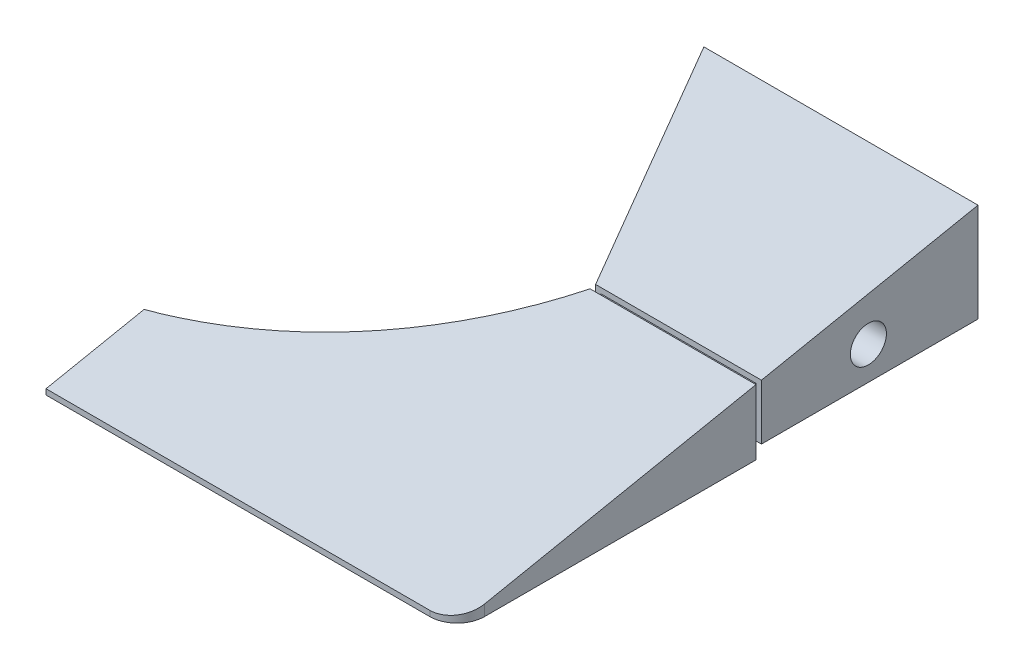
ISO-10303-21;
HEADER;
FILE_DESCRIPTION(('STEP AP214'),'2;1');
FILE_NAME('part.step','',(''),(''),'','','');
FILE_SCHEMA(('AUTOMOTIVE_DESIGN { 1 0 10303 214 1 1 1 1 }'));
ENDSEC;
DATA;
#1=APPLICATION_CONTEXT('core data for automotive mechanical design processes');
#2=APPLICATION_PROTOCOL_DEFINITION('international standard','automotive_design',2000,#1);
#3=PRODUCT_CONTEXT('',#1,'mechanical');
#4=PRODUCT('Part','Part','',(#3));
#5=PRODUCT_RELATED_PRODUCT_CATEGORY('part','',(#4));
#6=PRODUCT_DEFINITION_FORMATION('','',#4);
#7=PRODUCT_DEFINITION_CONTEXT('part definition',#1,'design');
#8=PRODUCT_DEFINITION('design','',#6,#7);
#9=PRODUCT_DEFINITION_SHAPE('','',#8);
#10=(LENGTH_UNIT() NAMED_UNIT(*) SI_UNIT(.MILLI.,.METRE.));
#11=(NAMED_UNIT(*) PLANE_ANGLE_UNIT() SI_UNIT($,.RADIAN.));
#12=(NAMED_UNIT(*) SI_UNIT($,.STERADIAN.) SOLID_ANGLE_UNIT());
#13=UNCERTAINTY_MEASURE_WITH_UNIT(LENGTH_MEASURE(1.E-05),#10,'distance_accuracy_value','');
#14=(GEOMETRIC_REPRESENTATION_CONTEXT(3) GLOBAL_UNCERTAINTY_ASSIGNED_CONTEXT((#13)) GLOBAL_UNIT_ASSIGNED_CONTEXT((#10,
#11,#12)) REPRESENTATION_CONTEXT('',''));
#15=CARTESIAN_POINT('',(0.,0.,0.));
#16=DIRECTION('',(0.,0.,1.));
#17=DIRECTION('',(1.,0.,0.));
#18=AXIS2_PLACEMENT_3D('',#15,#16,#17);
#19=CARTESIAN_POINT('',(0.,0.,95.));
#20=DIRECTION('',(0.,0.,1.));
#21=DIRECTION('',(1.,0.,0.));
#22=AXIS2_PLACEMENT_3D('',#19,#20,#21);
#23=PLANE('',#22);
#24=DIRECTION('',(-1.,0.,0.));
#25=VECTOR('',#24,1.);
#26=CARTESIAN_POINT('',(267.812259244849,-8.99999999999993,95.));
#27=LINE('',#26,#25);
#28=CARTESIAN_POINT('',(60.,-9.,95.));
#29=VERTEX_POINT('',#28);
#30=CARTESIAN_POINT('',(-10.,-9.00000000000003,95.));
#31=VERTEX_POINT('',#30);
#32=EDGE_CURVE('E202',#29,#31,#27,.T.);
#33=ORIENTED_EDGE('',*,*,#32,.T.);
#34=DIRECTION('',(0.,1.,0.));
#35=VECTOR('',#34,1.);
#36=CARTESIAN_POINT('',(-9.99999999999999,-24.6539333542928,95.));
#37=LINE('',#36,#35);
#38=CARTESIAN_POINT('',(-10.,-10.,95.));
#39=VERTEX_POINT('',#38);
#40=EDGE_CURVE('E147',#39,#31,#37,.T.);
#41=ORIENTED_EDGE('',*,*,#40,.F.);
#42=DIRECTION('',(1.,0.,0.));
#43=VECTOR('',#42,1.);
#44=CARTESIAN_POINT('',(-65.,-10.,95.));
#45=LINE('',#44,#43);
#46=CARTESIAN_POINT('',(60.,-10.,95.));
#47=VERTEX_POINT('',#46);
#48=EDGE_CURVE('E178',#39,#47,#45,.T.);
#49=ORIENTED_EDGE('',*,*,#48,.T.);
#50=DIRECTION('',(0.,1.,0.));
#51=VECTOR('',#50,1.);
#52=CARTESIAN_POINT('',(60.,-9.,95.));
#53=LINE('',#52,#51);
#54=EDGE_CURVE('E169',#47,#29,#53,.T.);
#55=ORIENTED_EDGE('',*,*,#54,.T.);
#56=EDGE_LOOP('',(#33,#41,#49,#55));
#57=FACE_BOUND('',#56,.T.);
#58=ADVANCED_FACE('F39',(#57),#23,.T.);
#59=CARTESIAN_POINT('',(267.812259244849,10.0000000000001,0.));
#60=DIRECTION('',(0.,-0.98058067569092,-0.196116135138184));
#61=DIRECTION('',(0.,0.196116135138184,-0.98058067569092));
#62=AXIS2_PLACEMENT_3D('',#59,#60,#61);
#63=PLANE('',#62);
#64=DIRECTION('',(0.,-0.196116135138184,0.98058067569092));
#65=VECTOR('',#64,1.);
#66=CARTESIAN_POINT('',(-10.,-5.42201027736971,77.1100513868484));
#67=LINE('',#66,#65);
#68=CARTESIAN_POINT('',(-10.0000000000001,-5.42201027736971,77.1100513868484));
#69=VERTEX_POINT('',#68);
#70=EDGE_CURVE('E144',#69,#31,#67,.T.);
#71=ORIENTED_EDGE('',*,*,#70,.T.);
#72=ORIENTED_EDGE('',*,*,#32,.F.);
#73=CARTESIAN_POINT('',(60.,-8.,90.));
#74=DIRECTION('',(0.,-0.98058067569092,-0.196116135138184));
#75=DIRECTION('',(0.,-0.196116135138184,0.98058067569092));
#76=AXIS2_PLACEMENT_3D('',#73,#74,#75);
#77=ELLIPSE('',#76,5.09901951359278,5.);
#78=CARTESIAN_POINT('',(65.,-8.,90.));
#79=VERTEX_POINT('',#78);
#80=EDGE_CURVE('E175',#29,#79,#77,.F.);
#81=ORIENTED_EDGE('',*,*,#80,.T.);
#82=DIRECTION('',(0.,-0.196116135138184,0.98058067569092));
#83=VECTOR('',#82,1.);
#84=CARTESIAN_POINT('',(65.,-8.26923076923077,91.3461538461539));
#85=LINE('',#84,#83);
#86=CARTESIAN_POINT('',(65.,1.89999999999999,40.5));
#87=VERTEX_POINT('',#86);
#88=EDGE_CURVE('E204',#87,#79,#85,.T.);
#89=ORIENTED_EDGE('',*,*,#88,.F.);
#90=DIRECTION('',(-1.,0.,0.));
#91=VECTOR('',#90,1.);
#92=CARTESIAN_POINT('',(267.812259244849,1.90000000000006,40.5));
#93=LINE('',#92,#91);
#94=CARTESIAN_POINT('',(34.741705057642,1.89999999999998,40.5));
#95=VERTEX_POINT('',#94);
#96=EDGE_CURVE('E48',#87,#95,#93,.T.);
#97=ORIENTED_EDGE('',*,*,#96,.T.);
#98=CARTESIAN_POINT('',(-30.4033638672732,8.69399998459829,6.53000007700834));
#99=DIRECTION('',(0.,-0.98058067569092,-0.196116135138184));
#100=DIRECTION('',(0.,0.196116135138184,-0.98058067569092));
#101=AXIS2_PLACEMENT_3D('',#98,#99,#100);
#102=ELLIPSE('',#101,74.9249927327324,73.47);
#103=EDGE_CURVE('E159',#69,#95,#102,.F.);
#104=ORIENTED_EDGE('',*,*,#103,.F.);
#105=EDGE_LOOP('',(#71,#72,#81,#89,#97,#104));
#106=FACE_BOUND('',#105,.T.);
#107=ADVANCED_FACE('F166',(#106),#63,.F.);
#108=CARTESIAN_POINT('',(-30.4033638672732,-10.001,6.53000007700834));
#109=DIRECTION('',(0.,1.,0.));
#110=DIRECTION('',(0.,0.,1.));
#111=AXIS2_PLACEMENT_3D('',#108,#109,#110);
#112=CYLINDRICAL_SURFACE('',#111,73.47);
#113=DIRECTION('',(0.,1.,0.));
#114=VECTOR('',#113,1.);
#115=CARTESIAN_POINT('',(-10.,-10.001,77.1100513868483));
#116=LINE('',#115,#114);
#117=CARTESIAN_POINT('',(-10.,-10.,77.1100513868483));
#118=VERTEX_POINT('',#117);
#119=EDGE_CURVE('E55',#118,#69,#116,.T.);
#120=ORIENTED_EDGE('',*,*,#119,.T.);
#121=ORIENTED_EDGE('',*,*,#103,.T.);
#122=DIRECTION('',(0.,1.,0.));
#123=VECTOR('',#122,1.);
#124=CARTESIAN_POINT('',(34.741705057642,-10.001,40.5));
#125=LINE('',#124,#123);
#126=CARTESIAN_POINT('',(34.741705057642,-10.,40.5));
#127=VERTEX_POINT('',#126);
#128=EDGE_CURVE('E205',#95,#127,#125,.F.);
#129=ORIENTED_EDGE('',*,*,#128,.T.);
#130=CARTESIAN_POINT('',(-30.4033638672732,-10.,6.53000007700834));
#131=DIRECTION('',(0.,1.,0.));
#132=DIRECTION('',(0.,0.,1.));
#133=AXIS2_PLACEMENT_3D('',#130,#131,#132);
#134=CIRCLE('',#133,73.47);
#135=EDGE_CURVE('E162',#127,#118,#134,.F.);
#136=ORIENTED_EDGE('',*,*,#135,.T.);
#137=EDGE_LOOP('',(#120,#121,#129,#136));
#138=FACE_BOUND('',#137,.T.);
#139=ADVANCED_FACE('F158',(#138),#112,.F.);
#140=CARTESIAN_POINT('',(-65.,-10.,95.));
#141=DIRECTION('',(0.,1.,0.));
#142=DIRECTION('',(0.,0.,1.));
#143=AXIS2_PLACEMENT_3D('',#140,#141,#142);
#144=PLANE('',#143);
#145=DIRECTION('',(0.,0.,-1.));
#146=VECTOR('',#145,1.);
#147=CARTESIAN_POINT('',(-10.,-10.,73.2636667714638));
#148=LINE('',#147,#146);
#149=EDGE_CURVE('E154',#39,#118,#148,.T.);
#150=ORIENTED_EDGE('',*,*,#149,.T.);
#151=ORIENTED_EDGE('',*,*,#135,.F.);
#152=DIRECTION('',(1.,0.,0.));
#153=VECTOR('',#152,1.);
#154=CARTESIAN_POINT('',(-65.,-10.,40.5));
#155=LINE('',#154,#153);
#156=CARTESIAN_POINT('',(65.,-10.,40.5));
#157=VERTEX_POINT('',#156);
#158=EDGE_CURVE('E210',#127,#157,#155,.T.);
#159=ORIENTED_EDGE('',*,*,#158,.T.);
#160=DIRECTION('',(0.,0.,-1.));
#161=VECTOR('',#160,1.);
#162=CARTESIAN_POINT('',(65.,-10.,95.));
#163=LINE('',#162,#161);
#164=CARTESIAN_POINT('',(65.,-10.,90.));
#165=VERTEX_POINT('',#164);
#166=EDGE_CURVE('E170',#165,#157,#163,.T.);
#167=ORIENTED_EDGE('',*,*,#166,.F.);
#168=CARTESIAN_POINT('',(60.,-10.,90.));
#169=DIRECTION('',(0.,1.,0.));
#170=DIRECTION('',(0.,0.,1.));
#171=AXIS2_PLACEMENT_3D('',#168,#169,#170);
#172=CIRCLE('',#171,5.);
#173=EDGE_CURVE('E188',#165,#47,#172,.F.);
#174=ORIENTED_EDGE('',*,*,#173,.T.);
#175=ORIENTED_EDGE('',*,*,#48,.F.);
#176=EDGE_LOOP('',(#150,#151,#159,#167,#174,#175));
#177=FACE_BOUND('',#176,.T.);
#178=ADVANCED_FACE('F197',(#177),#144,.F.);
#179=CARTESIAN_POINT('',(60.,0.,90.));
#180=DIRECTION('',(0.,-1.,0.));
#181=DIRECTION('',(0.,0.,-1.));
#182=AXIS2_PLACEMENT_3D('',#179,#180,#181);
#183=CYLINDRICAL_SURFACE('',#182,5.);
#184=ORIENTED_EDGE('',*,*,#173,.F.);
#185=DIRECTION('',(0.,1.,0.));
#186=VECTOR('',#185,1.);
#187=CARTESIAN_POINT('',(65.,-10.,90.));
#188=LINE('',#187,#186);
#189=EDGE_CURVE('E185',#79,#165,#188,.F.);
#190=ORIENTED_EDGE('',*,*,#189,.F.);
#191=ORIENTED_EDGE('',*,*,#80,.F.);
#192=ORIENTED_EDGE('',*,*,#54,.F.);
#193=EDGE_LOOP('',(#184,#190,#191,#192));
#194=FACE_BOUND('',#193,.T.);
#195=ADVANCED_FACE('F41',(#194),#183,.T.);
#196=CARTESIAN_POINT('',(65.,10.,95.));
#197=DIRECTION('',(-1.,0.,0.));
#198=DIRECTION('',(0.,0.,1.));
#199=AXIS2_PLACEMENT_3D('',#196,#197,#198);
#200=PLANE('',#199);
#201=ORIENTED_EDGE('',*,*,#166,.T.);
#202=DIRECTION('',(0.,-1.,0.));
#203=VECTOR('',#202,1.);
#204=CARTESIAN_POINT('',(65.,1.89999999999999,40.5));
#205=LINE('',#204,#203);
#206=EDGE_CURVE('E218',#87,#157,#205,.T.);
#207=ORIENTED_EDGE('',*,*,#206,.F.);
#208=ORIENTED_EDGE('',*,*,#88,.T.);
#209=ORIENTED_EDGE('',*,*,#189,.T.);
#210=EDGE_LOOP('',(#201,#207,#208,#209));
#211=FACE_BOUND('',#210,.T.);
#212=ADVANCED_FACE('F328',(#211),#200,.F.);
#213=CARTESIAN_POINT('',(-65.,1.89999999999999,40.5));
#214=DIRECTION('',(0.,0.,1.));
#215=DIRECTION('',(1.,0.,0.));
#216=AXIS2_PLACEMENT_3D('',#213,#214,#215);
#217=PLANE('',#216);
#218=DIRECTION('',(-1.,0.,0.));
#219=VECTOR('',#218,1.);
#220=CARTESIAN_POINT('',(35.75,1.09999999999999,40.5));
#221=LINE('',#220,#219);
#222=CARTESIAN_POINT('',(64.,1.09999999999999,40.5));
#223=VERTEX_POINT('',#222);
#224=CARTESIAN_POINT('',(35.75,1.09999999999999,40.5));
#225=VERTEX_POINT('',#224);
#226=EDGE_CURVE('E222',#223,#225,#221,.T.);
#227=ORIENTED_EDGE('',*,*,#226,.T.);
#228=DIRECTION('',(0.,-1.,0.));
#229=VECTOR('',#228,1.);
#230=CARTESIAN_POINT('',(35.75,1.09999999999999,40.5));
#231=LINE('',#230,#229);
#232=CARTESIAN_POINT('',(35.75,-7.,40.5));
#233=VERTEX_POINT('',#232);
#234=EDGE_CURVE('E235',#225,#233,#231,.T.);
#235=ORIENTED_EDGE('',*,*,#234,.T.);
#236=DIRECTION('',(1.,0.,0.));
#237=VECTOR('',#236,1.);
#238=CARTESIAN_POINT('',(35.75,-7.,40.5));
#239=LINE('',#238,#237);
#240=CARTESIAN_POINT('',(64.,-7.,40.5));
#241=VERTEX_POINT('',#240);
#242=EDGE_CURVE('E231',#233,#241,#239,.T.);
#243=ORIENTED_EDGE('',*,*,#242,.T.);
#244=DIRECTION('',(0.,1.,0.));
#245=VECTOR('',#244,1.);
#246=CARTESIAN_POINT('',(64.,1.09999999999999,40.5));
#247=LINE('',#246,#245);
#248=EDGE_CURVE('E226',#241,#223,#247,.T.);
#249=ORIENTED_EDGE('',*,*,#248,.T.);
#250=EDGE_LOOP('',(#227,#235,#243,#249));
#251=FACE_BOUND('',#250,.T.);
#252=ORIENTED_EDGE('',*,*,#206,.T.);
#253=ORIENTED_EDGE('',*,*,#158,.F.);
#254=ORIENTED_EDGE('',*,*,#128,.F.);
#255=ORIENTED_EDGE('',*,*,#96,.F.);
#256=EDGE_LOOP('',(#252,#253,#254,#255));
#257=FACE_BOUND('',#256,.T.);
#258=ADVANCED_FACE('F329',(#251,#257),#217,.F.);
#259=CARTESIAN_POINT('',(35.75,1.09999999999999,95.002));
#260=DIRECTION('',(1.,0.,0.));
#261=DIRECTION('',(0.,0.,-1.));
#262=AXIS2_PLACEMENT_3D('',#259,#260,#261);
#263=PLANE('',#262);
#264=ORIENTED_EDGE('',*,*,#234,.F.);
#265=DIRECTION('',(0.,0.,-1.));
#266=VECTOR('',#265,1.);
#267=CARTESIAN_POINT('',(35.75,1.09999999999999,95.002));
#268=LINE('',#267,#266);
#269=CARTESIAN_POINT('',(35.75,1.09999999999999,39.5));
#270=VERTEX_POINT('',#269);
#271=EDGE_CURVE('E240',#225,#270,#268,.T.);
#272=ORIENTED_EDGE('',*,*,#271,.T.);
#273=DIRECTION('',(0.,-1.,0.));
#274=VECTOR('',#273,1.);
#275=CARTESIAN_POINT('',(35.75,1.09999999999999,39.5));
#276=LINE('',#275,#274);
#277=CARTESIAN_POINT('',(35.75,-7.,39.5));
#278=VERTEX_POINT('',#277);
#279=EDGE_CURVE('E221',#270,#278,#276,.T.);
#280=ORIENTED_EDGE('',*,*,#279,.T.);
#281=DIRECTION('',(0.,0.,-1.));
#282=VECTOR('',#281,1.);
#283=CARTESIAN_POINT('',(35.75,-7.,95.002));
#284=LINE('',#283,#282);
#285=EDGE_CURVE('E239',#233,#278,#284,.T.);
#286=ORIENTED_EDGE('',*,*,#285,.F.);
#287=EDGE_LOOP('',(#264,#272,#280,#286));
#288=FACE_BOUND('',#287,.T.);
#289=ADVANCED_FACE('F331',(#288),#263,.F.);
#290=CARTESIAN_POINT('',(35.75,-7.,95.002));
#291=DIRECTION('',(0.,1.,0.));
#292=DIRECTION('',(0.,0.,1.));
#293=AXIS2_PLACEMENT_3D('',#290,#291,#292);
#294=PLANE('',#293);
#295=ORIENTED_EDGE('',*,*,#242,.F.);
#296=ORIENTED_EDGE('',*,*,#285,.T.);
#297=DIRECTION('',(1.,0.,0.));
#298=VECTOR('',#297,1.);
#299=CARTESIAN_POINT('',(35.75,-7.,39.5));
#300=LINE('',#299,#298);
#301=CARTESIAN_POINT('',(64.,-7.,39.5));
#302=VERTEX_POINT('',#301);
#303=EDGE_CURVE('E256',#278,#302,#300,.T.);
#304=ORIENTED_EDGE('',*,*,#303,.T.);
#305=DIRECTION('',(0.,0.,-1.));
#306=VECTOR('',#305,1.);
#307=CARTESIAN_POINT('',(64.,-7.,95.002));
#308=LINE('',#307,#306);
#309=EDGE_CURVE('E249',#241,#302,#308,.T.);
#310=ORIENTED_EDGE('',*,*,#309,.F.);
#311=EDGE_LOOP('',(#295,#296,#304,#310));
#312=FACE_BOUND('',#311,.T.);
#313=ADVANCED_FACE('F339',(#312),#294,.F.);
#314=CARTESIAN_POINT('',(64.,1.09999999999999,95.002));
#315=DIRECTION('',(-1.,0.,0.));
#316=DIRECTION('',(0.,0.,1.));
#317=AXIS2_PLACEMENT_3D('',#314,#315,#316);
#318=PLANE('',#317);
#319=ORIENTED_EDGE('',*,*,#248,.F.);
#320=ORIENTED_EDGE('',*,*,#309,.T.);
#321=DIRECTION('',(0.,1.,0.));
#322=VECTOR('',#321,1.);
#323=CARTESIAN_POINT('',(64.,1.09999999999999,39.5));
#324=LINE('',#323,#322);
#325=CARTESIAN_POINT('',(64.,1.09999999999999,39.5));
#326=VERTEX_POINT('',#325);
#327=EDGE_CURVE('E260',#302,#326,#324,.T.);
#328=ORIENTED_EDGE('',*,*,#327,.T.);
#329=DIRECTION('',(0.,0.,-1.));
#330=VECTOR('',#329,1.);
#331=CARTESIAN_POINT('',(64.,1.09999999999999,95.002));
#332=LINE('',#331,#330);
#333=EDGE_CURVE('E245',#223,#326,#332,.T.);
#334=ORIENTED_EDGE('',*,*,#333,.F.);
#335=EDGE_LOOP('',(#319,#320,#328,#334));
#336=FACE_BOUND('',#335,.T.);
#337=ADVANCED_FACE('F346',(#336),#318,.F.);
#338=CARTESIAN_POINT('',(35.75,1.09999999999999,95.002));
#339=DIRECTION('',(0.,-1.,0.));
#340=DIRECTION('',(0.,0.,-1.));
#341=AXIS2_PLACEMENT_3D('',#338,#339,#340);
#342=PLANE('',#341);
#343=ORIENTED_EDGE('',*,*,#226,.F.);
#344=ORIENTED_EDGE('',*,*,#333,.T.);
#345=DIRECTION('',(-1.,0.,0.));
#346=VECTOR('',#345,1.);
#347=CARTESIAN_POINT('',(35.75,1.09999999999999,39.5));
#348=LINE('',#347,#346);
#349=EDGE_CURVE('E244',#326,#270,#348,.T.);
#350=ORIENTED_EDGE('',*,*,#349,.T.);
#351=ORIENTED_EDGE('',*,*,#271,.F.);
#352=EDGE_LOOP('',(#343,#344,#350,#351));
#353=FACE_BOUND('',#352,.T.);
#354=ADVANCED_FACE('F334',(#353),#342,.F.);
#355=CARTESIAN_POINT('',(65.,10.,95.));
#356=DIRECTION('',(-1.,0.,0.));
#357=DIRECTION('',(0.,0.,1.));
#358=AXIS2_PLACEMENT_3D('',#355,#356,#357);
#359=PLANE('',#358);
#360=CARTESIAN_POINT('',(65.,-1.945,20.));
#361=DIRECTION('',(1.,0.,0.));
#362=DIRECTION('',(0.,0.,-1.));
#363=AXIS2_PLACEMENT_3D('',#360,#361,#362);
#364=CIRCLE('',#363,3.2899985);
#365=CARTESIAN_POINT('',(65.,-1.945,16.7100015));
#366=VERTEX_POINT('',#365);
#367=EDGE_CURVE('E291',#366,#366,#364,.T.);
#368=ORIENTED_EDGE('',*,*,#367,.F.);
#369=EDGE_LOOP('',(#368));
#370=FACE_BOUND('',#369,.T.);
#371=DIRECTION('',(0.,1.,0.));
#372=VECTOR('',#371,1.);
#373=CARTESIAN_POINT('',(65.,-10.,39.5));
#374=LINE('',#373,#372);
#375=CARTESIAN_POINT('',(65.,-8.,39.5));
#376=VERTEX_POINT('',#375);
#377=CARTESIAN_POINT('',(65.,2.09999999999999,39.5));
#378=VERTEX_POINT('',#377);
#379=EDGE_CURVE('E227',#376,#378,#374,.T.);
#380=ORIENTED_EDGE('',*,*,#379,.F.);
#381=DIRECTION('',(0.,0.,-1.));
#382=VECTOR('',#381,1.);
#383=CARTESIAN_POINT('',(65.,-8.,40.5));
#384=LINE('',#383,#382);
#385=CARTESIAN_POINT('',(65.,-8.,0.));
#386=VERTEX_POINT('',#385);
#387=EDGE_CURVE('E63',#376,#386,#384,.T.);
#388=ORIENTED_EDGE('',*,*,#387,.T.);
#389=DIRECTION('',(0.,1.,0.));
#390=VECTOR('',#389,1.);
#391=CARTESIAN_POINT('',(65.,10.,0.));
#392=LINE('',#391,#390);
#393=CARTESIAN_POINT('',(65.,9.99999999999998,0.));
#394=VERTEX_POINT('',#393);
#395=EDGE_CURVE('E274',#386,#394,#392,.T.);
#396=ORIENTED_EDGE('',*,*,#395,.T.);
#397=DIRECTION('',(0.,-0.196116135138184,0.98058067569092));
#398=VECTOR('',#397,1.);
#399=CARTESIAN_POINT('',(65.,-8.26923076923077,91.3461538461539));
#400=LINE('',#399,#398);
#401=EDGE_CURVE('E270',#394,#378,#400,.T.);
#402=ORIENTED_EDGE('',*,*,#401,.T.);
#403=EDGE_LOOP('',(#380,#388,#396,#402));
#404=FACE_BOUND('',#403,.T.);
#405=ADVANCED_FACE('F342',(#370,#404),#359,.F.);
#406=CARTESIAN_POINT('',(0.,0.,0.));
#407=DIRECTION('',(0.,0.,1.));
#408=DIRECTION('',(1.,0.,0.));
#409=AXIS2_PLACEMENT_3D('',#406,#407,#408);
#410=PLANE('',#409);
#411=ORIENTED_EDGE('',*,*,#395,.F.);
#412=DIRECTION('',(1.,0.,0.));
#413=VECTOR('',#412,1.);
#414=CARTESIAN_POINT('',(65.,-8.,0.));
#415=LINE('',#414,#413);
#416=CARTESIAN_POINT('',(15.,-8.,0.));
#417=VERTEX_POINT('',#416);
#418=EDGE_CURVE('E153',#417,#386,#415,.T.);
#419=ORIENTED_EDGE('',*,*,#418,.F.);
#420=DIRECTION('',(0.,1.,0.));
#421=VECTOR('',#420,1.);
#422=CARTESIAN_POINT('',(15.,-10.001,0.));
#423=LINE('',#422,#421);
#424=CARTESIAN_POINT('',(15.,9.99999999999997,0.));
#425=VERTEX_POINT('',#424);
#426=EDGE_CURVE('E283',#417,#425,#423,.T.);
#427=ORIENTED_EDGE('',*,*,#426,.T.);
#428=DIRECTION('',(-1.,0.,0.));
#429=VECTOR('',#428,1.);
#430=CARTESIAN_POINT('',(-65.,10.,0.));
#431=LINE('',#430,#429);
#432=EDGE_CURVE('E299',#394,#425,#431,.T.);
#433=ORIENTED_EDGE('',*,*,#432,.F.);
#434=EDGE_LOOP('',(#411,#419,#427,#433));
#435=FACE_BOUND('',#434,.T.);
#436=ADVANCED_FACE('F408',(#435),#410,.F.);
#437=CARTESIAN_POINT('',(35.,-10.001,40.));
#438=DIRECTION('',(0.894427190999916,0.,-0.447213595499958));
#439=DIRECTION('',(-0.447213595499958,0.,-0.894427190999916));
#440=AXIS2_PLACEMENT_3D('',#437,#438,#439);
#441=PLANE('',#440);
#442=CARTESIAN_POINT('',(23.9442719099992,-1.945,17.8885438199983));
#443=DIRECTION('',(-0.894427190999916,0.,0.447213595499958));
#444=DIRECTION('',(0.447213595499958,0.,0.894427190999916));
#445=AXIS2_PLACEMENT_3D('',#442,#443,#444);
#446=CIRCLE('',#445,3.28999849999999);
#447=CARTESIAN_POINT('',(25.4156039683736,-1.945,20.8312079367473));
#448=VERTEX_POINT('',#447);
#449=EDGE_CURVE('E278',#448,#448,#446,.T.);
#450=ORIENTED_EDGE('',*,*,#449,.F.);
#451=EDGE_LOOP('',(#450));
#452=FACE_BOUND('',#451,.T.);
#453=ORIENTED_EDGE('',*,*,#426,.F.);
#454=DIRECTION('',(0.447213595499958,0.,0.894427190999916));
#455=VECTOR('',#454,1.);
#456=CARTESIAN_POINT('',(35.,-8.,40.));
#457=LINE('',#456,#455);
#458=CARTESIAN_POINT('',(34.75,-8.,39.5));
#459=VERTEX_POINT('',#458);
#460=EDGE_CURVE('E275',#417,#459,#457,.T.);
#461=ORIENTED_EDGE('',*,*,#460,.T.);
#462=DIRECTION('',(0.,1.,0.));
#463=VECTOR('',#462,1.);
#464=CARTESIAN_POINT('',(34.75,-10.001,39.5));
#465=LINE('',#464,#463);
#466=CARTESIAN_POINT('',(34.75,2.09999999999999,39.5));
#467=VERTEX_POINT('',#466);
#468=EDGE_CURVE('E279',#459,#467,#465,.T.);
#469=ORIENTED_EDGE('',*,*,#468,.T.);
#470=DIRECTION('',(-0.440225453162812,0.176090181265125,-0.880450906325624));
#471=VECTOR('',#470,1.);
#472=CARTESIAN_POINT('',(35.9303100775194,1.62787596899223,41.8606201550388));
#473=LINE('',#472,#471);
#474=EDGE_CURVE('E282',#467,#425,#473,.T.);
#475=ORIENTED_EDGE('',*,*,#474,.T.);
#476=EDGE_LOOP('',(#453,#461,#469,#475));
#477=FACE_BOUND('',#476,.T.);
#478=ADVANCED_FACE('F402',(#452,#477),#441,.F.);
#479=CARTESIAN_POINT('',(267.812259244849,10.0000000000001,0.));
#480=DIRECTION('',(0.,-0.98058067569092,-0.196116135138184));
#481=DIRECTION('',(0.,0.196116135138184,-0.98058067569092));
#482=AXIS2_PLACEMENT_3D('',#479,#480,#481);
#483=PLANE('',#482);
#484=ORIENTED_EDGE('',*,*,#474,.F.);
#485=DIRECTION('',(1.,0.,0.));
#486=VECTOR('',#485,1.);
#487=CARTESIAN_POINT('',(267.812259244849,2.10000000000006,39.5));
#488=LINE('',#487,#486);
#489=EDGE_CURVE('E303',#467,#378,#488,.T.);
#490=ORIENTED_EDGE('',*,*,#489,.T.);
#491=ORIENTED_EDGE('',*,*,#401,.F.);
#492=ORIENTED_EDGE('',*,*,#432,.T.);
#493=EDGE_LOOP('',(#484,#490,#491,#492));
#494=FACE_BOUND('',#493,.T.);
#495=ADVANCED_FACE('F407',(#494),#483,.F.);
#496=CARTESIAN_POINT('',(55.,-1.945,20.));
#497=DIRECTION('',(1.,0.,0.));
#498=DIRECTION('',(0.,0.,-1.));
#499=AXIS2_PLACEMENT_3D('',#496,#497,#498);
#500=CONICAL_SURFACE('',#499,3.2899985,1.02974425867665);
#501=CARTESIAN_POINT('',(53.0231694646903,-1.945,20.));
#502=VERTEX_POINT('',#501);
#503=VERTEX_LOOP('',#502);
#504=FACE_BOUND('',#503,.T.);
#505=CARTESIAN_POINT('',(55.,-1.945,20.));
#506=DIRECTION('',(1.,0.,0.));
#507=DIRECTION('',(0.,0.,-1.));
#508=AXIS2_PLACEMENT_3D('',#505,#506,#507);
#509=CIRCLE('',#508,3.2899985);
#510=CARTESIAN_POINT('',(55.,-1.945,16.7100015));
#511=VERTEX_POINT('',#510);
#512=EDGE_CURVE('E295',#511,#511,#509,.T.);
#513=ORIENTED_EDGE('',*,*,#512,.T.);
#514=EDGE_LOOP('',(#513));
#515=FACE_BOUND('',#514,.T.);
#516=ADVANCED_FACE('F467',(#504,#515),#500,.F.);
#517=CARTESIAN_POINT('',(65.,-1.945,20.));
#518=DIRECTION('',(1.,0.,0.));
#519=DIRECTION('',(0.,0.,-1.));
#520=AXIS2_PLACEMENT_3D('',#517,#518,#519);
#521=CYLINDRICAL_SURFACE('',#520,3.2899985);
#522=ORIENTED_EDGE('',*,*,#512,.F.);
#523=EDGE_LOOP('',(#522));
#524=FACE_BOUND('',#523,.T.);
#525=ORIENTED_EDGE('',*,*,#367,.T.);
#526=EDGE_LOOP('',(#525));
#527=FACE_BOUND('',#526,.T.);
#528=ADVANCED_FACE('F457',(#524,#527),#521,.F.);
#529=CARTESIAN_POINT('',(32.8885438199983,-1.945,13.4164078649987));
#530=DIRECTION('',(-0.894427190999916,0.,0.447213595499958));
#531=DIRECTION('',(0.447213595499958,0.,0.894427190999916));
#532=AXIS2_PLACEMENT_3D('',#529,#530,#531);
#533=CONICAL_SURFACE('',#532,3.28999849999999,1.02974425867665);
#534=CARTESIAN_POINT('',(34.6566748027783,-1.945,12.5323423736088));
#535=VERTEX_POINT('',#534);
#536=VERTEX_LOOP('',#535);
#537=FACE_BOUND('',#536,.T.);
#538=CARTESIAN_POINT('',(32.8885438199983,-1.945,13.4164078649987));
#539=DIRECTION('',(-0.894427190999916,0.,0.447213595499958));
#540=DIRECTION('',(0.447213595499958,0.,0.894427190999916));
#541=AXIS2_PLACEMENT_3D('',#538,#539,#540);
#542=CIRCLE('',#541,3.28999849999999);
#543=CARTESIAN_POINT('',(34.3598758783728,-1.945,16.3590719817477));
#544=VERTEX_POINT('',#543);
#545=EDGE_CURVE('E287',#544,#544,#542,.T.);
#546=ORIENTED_EDGE('',*,*,#545,.T.);
#547=EDGE_LOOP('',(#546));
#548=FACE_BOUND('',#547,.T.);
#549=ADVANCED_FACE('F447',(#537,#548),#533,.F.);
#550=CARTESIAN_POINT('',(23.9442719099992,-1.945,17.8885438199983));
#551=DIRECTION('',(-0.894427190999916,0.,0.447213595499958));
#552=DIRECTION('',(0.447213595499958,0.,0.894427190999916));
#553=AXIS2_PLACEMENT_3D('',#550,#551,#552);
#554=CYLINDRICAL_SURFACE('',#553,3.28999849999999);
#555=ORIENTED_EDGE('',*,*,#545,.F.);
#556=EDGE_LOOP('',(#555));
#557=FACE_BOUND('',#556,.T.);
#558=ORIENTED_EDGE('',*,*,#449,.T.);
#559=EDGE_LOOP('',(#558));
#560=FACE_BOUND('',#559,.T.);
#561=ADVANCED_FACE('F393',(#557,#560),#554,.F.);
#562=CARTESIAN_POINT('',(-65.,-10.,39.5));
#563=DIRECTION('',(0.,0.,-1.));
#564=DIRECTION('',(-1.,0.,0.));
#565=AXIS2_PLACEMENT_3D('',#562,#563,#564);
#566=PLANE('',#565);
#567=ORIENTED_EDGE('',*,*,#279,.F.);
#568=ORIENTED_EDGE('',*,*,#349,.F.);
#569=ORIENTED_EDGE('',*,*,#327,.F.);
#570=ORIENTED_EDGE('',*,*,#303,.F.);
#571=EDGE_LOOP('',(#567,#568,#569,#570));
#572=FACE_BOUND('',#571,.T.);
#573=ORIENTED_EDGE('',*,*,#468,.F.);
#574=DIRECTION('',(1.,0.,0.));
#575=VECTOR('',#574,1.);
#576=CARTESIAN_POINT('',(-65.,-8.,39.5));
#577=LINE('',#576,#575);
#578=EDGE_CURVE('E11',#459,#376,#577,.T.);
#579=ORIENTED_EDGE('',*,*,#578,.T.);
#580=ORIENTED_EDGE('',*,*,#379,.T.);
#581=ORIENTED_EDGE('',*,*,#489,.F.);
#582=EDGE_LOOP('',(#573,#579,#580,#581));
#583=FACE_BOUND('',#582,.T.);
#584=ADVANCED_FACE('F381',(#572,#583),#566,.F.);
#585=CARTESIAN_POINT('',(65.,-8.,40.5));
#586=DIRECTION('',(0.,1.,0.));
#587=DIRECTION('',(0.,0.,1.));
#588=AXIS2_PLACEMENT_3D('',#585,#586,#587);
#589=PLANE('',#588);
#590=ORIENTED_EDGE('',*,*,#418,.T.);
#591=ORIENTED_EDGE('',*,*,#387,.F.);
#592=ORIENTED_EDGE('',*,*,#578,.F.);
#593=ORIENTED_EDGE('',*,*,#460,.F.);
#594=EDGE_LOOP('',(#590,#591,#592,#593));
#595=FACE_BOUND('',#594,.T.);
#596=ADVANCED_FACE('F376',(#595),#589,.F.);
#597=CARTESIAN_POINT('',(-10.,-24.6539333542928,73.2636667714638));
#598=DIRECTION('',(-1.,0.,0.));
#599=DIRECTION('',(0.,0.,1.));
#600=AXIS2_PLACEMENT_3D('',#597,#598,#599);
#601=PLANE('',#600);
#602=ORIENTED_EDGE('',*,*,#40,.T.);
#603=ORIENTED_EDGE('',*,*,#70,.F.);
#604=ORIENTED_EDGE('',*,*,#119,.F.);
#605=ORIENTED_EDGE('',*,*,#149,.F.);
#606=EDGE_LOOP('',(#602,#603,#604,#605));
#607=FACE_BOUND('',#606,.T.);
#608=ADVANCED_FACE('F145',(#607),#601,.T.);
#609=CLOSED_SHELL('',(#58,#107,#139,#178,#195,#212,#258,#289,#313,#337,#354,#405,#436,#478,#495,
#516,#528,#549,#561,#584,#596,#608));
#610=MANIFOLD_SOLID_BREP('B2',#609);
#611=ADVANCED_BREP_SHAPE_REPRESENTATION('',(#18,#610),#14);
#612=SHAPE_DEFINITION_REPRESENTATION(#9,#611);
ENDSEC;
END-ISO-10303-21;
